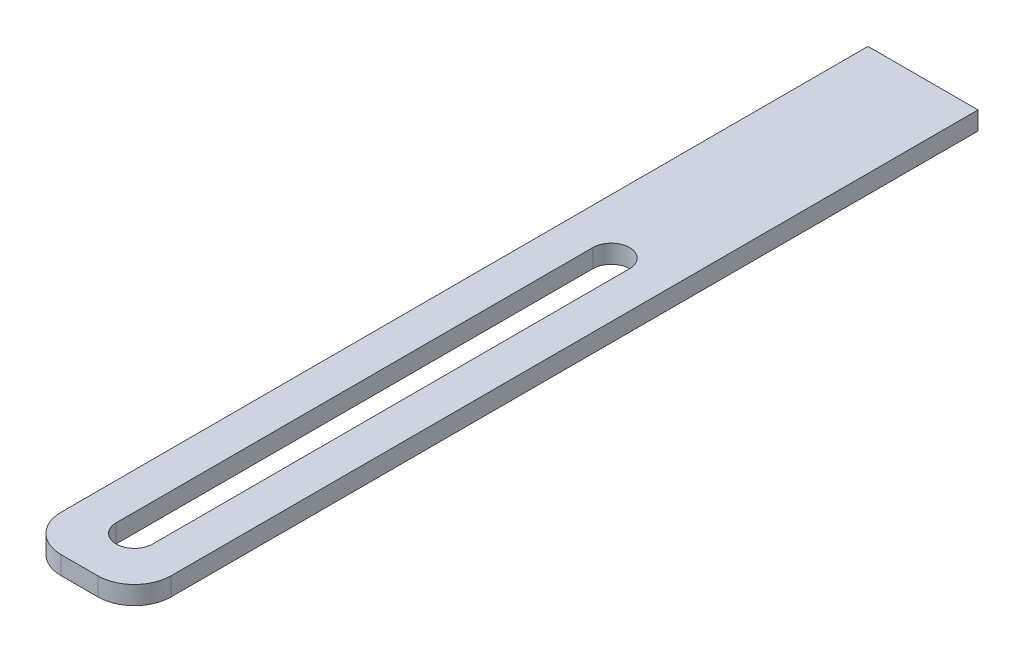
ISO-10303-21;
HEADER;
FILE_DESCRIPTION(('STEP AP214'),'2;1');
FILE_NAME('part.step','',(''),(''),'','','');
FILE_SCHEMA(('AUTOMOTIVE_DESIGN { 1 0 10303 214 1 1 1 1 }'));
ENDSEC;
DATA;
#1=APPLICATION_CONTEXT('core data for automotive mechanical design processes');
#2=APPLICATION_PROTOCOL_DEFINITION('international standard','automotive_design',2000,#1);
#3=PRODUCT_CONTEXT('',#1,'mechanical');
#4=PRODUCT('Part','Part','',(#3));
#5=PRODUCT_RELATED_PRODUCT_CATEGORY('part','',(#4));
#6=PRODUCT_DEFINITION_FORMATION('','',#4);
#7=PRODUCT_DEFINITION_CONTEXT('part definition',#1,'design');
#8=PRODUCT_DEFINITION('design','',#6,#7);
#9=PRODUCT_DEFINITION_SHAPE('','',#8);
#10=(LENGTH_UNIT() NAMED_UNIT(*) SI_UNIT(.MILLI.,.METRE.));
#11=(NAMED_UNIT(*) PLANE_ANGLE_UNIT() SI_UNIT($,.RADIAN.));
#12=(NAMED_UNIT(*) SI_UNIT($,.STERADIAN.) SOLID_ANGLE_UNIT());
#13=UNCERTAINTY_MEASURE_WITH_UNIT(LENGTH_MEASURE(1.E-05),#10,'distance_accuracy_value','');
#14=(GEOMETRIC_REPRESENTATION_CONTEXT(3) GLOBAL_UNCERTAINTY_ASSIGNED_CONTEXT((#13)) GLOBAL_UNIT_ASSIGNED_CONTEXT((#10,
#11,#12)) REPRESENTATION_CONTEXT('',''));
#15=CARTESIAN_POINT('',(0.,0.,0.));
#16=DIRECTION('',(0.,0.,1.));
#17=DIRECTION('',(1.,0.,0.));
#18=AXIS2_PLACEMENT_3D('',#15,#16,#17);
#19=CARTESIAN_POINT('',(305.,20.,205.));
#20=DIRECTION('',(0.,1.,0.));
#21=DIRECTION('',(0.,0.,1.));
#22=AXIS2_PLACEMENT_3D('',#19,#20,#21);
#23=PLANE('',#22);
#24=DIRECTION('',(0.,0.,1.));
#25=VECTOR('',#24,1.);
#26=CARTESIAN_POINT('',(285.,20.,205.));
#27=LINE('',#26,#25);
#28=CARTESIAN_POINT('',(285.,20.,-15.));
#29=VERTEX_POINT('',#28);
#30=CARTESIAN_POINT('',(285.,20.,205.));
#31=VERTEX_POINT('',#30);
#32=EDGE_CURVE('E169',#29,#31,#27,.T.);
#33=ORIENTED_EDGE('',*,*,#32,.T.);
#34=CARTESIAN_POINT('',(295.,20.,205.));
#35=DIRECTION('',(0.,1.,0.));
#36=DIRECTION('',(0.,0.,-1.));
#37=AXIS2_PLACEMENT_3D('',#34,#35,#36);
#38=CIRCLE('',#37,10.);
#39=CARTESIAN_POINT('',(295.,20.,215.));
#40=VERTEX_POINT('',#39);
#41=EDGE_CURVE('E173',#31,#40,#38,.T.);
#42=ORIENTED_EDGE('',*,*,#41,.T.);
#43=DIRECTION('',(1.,0.,0.));
#44=VECTOR('',#43,1.);
#45=CARTESIAN_POINT('',(305.,20.,215.));
#46=LINE('',#45,#44);
#47=CARTESIAN_POINT('',(305.,20.,215.));
#48=VERTEX_POINT('',#47);
#49=EDGE_CURVE('E177',#40,#48,#46,.T.);
#50=ORIENTED_EDGE('',*,*,#49,.T.);
#51=CARTESIAN_POINT('',(305.,20.,205.));
#52=DIRECTION('',(0.,1.,0.));
#53=DIRECTION('',(0.,0.,1.));
#54=AXIS2_PLACEMENT_3D('',#51,#52,#53);
#55=CIRCLE('',#54,10.);
#56=CARTESIAN_POINT('',(315.,20.,205.));
#57=VERTEX_POINT('',#56);
#58=EDGE_CURVE('E180',#48,#57,#55,.T.);
#59=ORIENTED_EDGE('',*,*,#58,.T.);
#60=DIRECTION('',(0.,0.,-1.));
#61=VECTOR('',#60,1.);
#62=CARTESIAN_POINT('',(315.,20.,205.));
#63=LINE('',#62,#61);
#64=CARTESIAN_POINT('',(315.,20.,-15.));
#65=VERTEX_POINT('',#64);
#66=EDGE_CURVE('E183',#57,#65,#63,.T.);
#67=ORIENTED_EDGE('',*,*,#66,.T.);
#68=DIRECTION('',(-1.,0.,0.));
#69=VECTOR('',#68,1.);
#70=CARTESIAN_POINT('',(315.,20.,-15.));
#71=LINE('',#70,#69);
#72=EDGE_CURVE('E186',#65,#29,#71,.T.);
#73=ORIENTED_EDGE('',*,*,#72,.T.);
#74=EDGE_LOOP('',(#33,#42,#50,#59,#67,#73));
#75=FACE_BOUND('',#74,.T.);
#76=DIRECTION('',(0.,0.,-1.));
#77=VECTOR('',#76,1.);
#78=CARTESIAN_POINT('',(305.,20.,200.));
#79=LINE('',#78,#77);
#80=CARTESIAN_POINT('',(305.,20.,200.));
#81=VERTEX_POINT('',#80);
#82=CARTESIAN_POINT('',(305.,20.,70.));
#83=VERTEX_POINT('',#82);
#84=EDGE_CURVE('E129',#81,#83,#79,.T.);
#85=ORIENTED_EDGE('',*,*,#84,.F.);
#86=CARTESIAN_POINT('',(300.,20.,200.));
#87=DIRECTION('',(0.,1.,0.));
#88=DIRECTION('',(0.,0.,1.));
#89=AXIS2_PLACEMENT_3D('',#86,#87,#88);
#90=CIRCLE('',#89,5.);
#91=CARTESIAN_POINT('',(295.,20.,200.));
#92=VERTEX_POINT('',#91);
#93=EDGE_CURVE('E120',#92,#81,#90,.T.);
#94=ORIENTED_EDGE('',*,*,#93,.F.);
#95=DIRECTION('',(0.,0.,1.));
#96=VECTOR('',#95,1.);
#97=CARTESIAN_POINT('',(295.,20.,200.));
#98=LINE('',#97,#96);
#99=CARTESIAN_POINT('',(295.,20.,70.));
#100=VERTEX_POINT('',#99);
#101=EDGE_CURVE('E147',#100,#92,#98,.T.);
#102=ORIENTED_EDGE('',*,*,#101,.F.);
#103=CARTESIAN_POINT('',(300.,20.,70.));
#104=DIRECTION('',(0.,1.,0.));
#105=DIRECTION('',(0.,0.,1.));
#106=AXIS2_PLACEMENT_3D('',#103,#104,#105);
#107=CIRCLE('',#106,5.00000000000012);
#108=EDGE_CURVE('E142',#83,#100,#107,.T.);
#109=ORIENTED_EDGE('',*,*,#108,.F.);
#110=EDGE_LOOP('',(#85,#94,#102,#109));
#111=FACE_BOUND('',#110,.T.);
#112=ADVANCED_FACE('F42',(#75,#111),#23,.T.);
#113=CARTESIAN_POINT('',(305.,15.,205.));
#114=DIRECTION('',(0.,1.,0.));
#115=DIRECTION('',(0.,0.,1.));
#116=AXIS2_PLACEMENT_3D('',#113,#114,#115);
#117=PLANE('',#116);
#118=DIRECTION('',(0.,0.,1.));
#119=VECTOR('',#118,1.);
#120=CARTESIAN_POINT('',(285.,15.,205.));
#121=LINE('',#120,#119);
#122=CARTESIAN_POINT('',(285.,15.,-15.));
#123=VERTEX_POINT('',#122);
#124=CARTESIAN_POINT('',(285.,15.,205.));
#125=VERTEX_POINT('',#124);
#126=EDGE_CURVE('E138',#123,#125,#121,.T.);
#127=ORIENTED_EDGE('',*,*,#126,.F.);
#128=DIRECTION('',(-1.,0.,0.));
#129=VECTOR('',#128,1.);
#130=CARTESIAN_POINT('',(315.,15.,-15.));
#131=LINE('',#130,#129);
#132=CARTESIAN_POINT('',(315.,15.,-15.));
#133=VERTEX_POINT('',#132);
#134=EDGE_CURVE('E174',#133,#123,#131,.T.);
#135=ORIENTED_EDGE('',*,*,#134,.F.);
#136=DIRECTION('',(0.,0.,-1.));
#137=VECTOR('',#136,1.);
#138=CARTESIAN_POINT('',(315.,15.,205.));
#139=LINE('',#138,#137);
#140=CARTESIAN_POINT('',(315.,15.,205.));
#141=VERTEX_POINT('',#140);
#142=EDGE_CURVE('E202',#141,#133,#139,.T.);
#143=ORIENTED_EDGE('',*,*,#142,.F.);
#144=CARTESIAN_POINT('',(305.,15.,205.));
#145=DIRECTION('',(0.,1.,0.));
#146=DIRECTION('',(0.,0.,1.));
#147=AXIS2_PLACEMENT_3D('',#144,#145,#146);
#148=CIRCLE('',#147,10.);
#149=CARTESIAN_POINT('',(305.,15.,215.));
#150=VERTEX_POINT('',#149);
#151=EDGE_CURVE('E199',#150,#141,#148,.T.);
#152=ORIENTED_EDGE('',*,*,#151,.F.);
#153=DIRECTION('',(1.,0.,0.));
#154=VECTOR('',#153,1.);
#155=CARTESIAN_POINT('',(305.,15.,215.));
#156=LINE('',#155,#154);
#157=CARTESIAN_POINT('',(295.,15.,215.));
#158=VERTEX_POINT('',#157);
#159=EDGE_CURVE('E196',#158,#150,#156,.T.);
#160=ORIENTED_EDGE('',*,*,#159,.F.);
#161=CARTESIAN_POINT('',(295.,15.,205.));
#162=DIRECTION('',(0.,1.,0.));
#163=DIRECTION('',(0.,0.,-1.));
#164=AXIS2_PLACEMENT_3D('',#161,#162,#163);
#165=CIRCLE('',#164,10.);
#166=EDGE_CURVE('E193',#125,#158,#165,.T.);
#167=ORIENTED_EDGE('',*,*,#166,.F.);
#168=EDGE_LOOP('',(#127,#135,#143,#152,#160,#167));
#169=FACE_BOUND('',#168,.T.);
#170=CARTESIAN_POINT('',(300.,15.,200.));
#171=DIRECTION('',(0.,1.,0.));
#172=DIRECTION('',(0.,0.,1.));
#173=AXIS2_PLACEMENT_3D('',#170,#171,#172);
#174=CIRCLE('',#173,5.);
#175=CARTESIAN_POINT('',(295.,15.,200.));
#176=VERTEX_POINT('',#175);
#177=CARTESIAN_POINT('',(305.,15.,200.));
#178=VERTEX_POINT('',#177);
#179=EDGE_CURVE('E66',#176,#178,#174,.T.);
#180=ORIENTED_EDGE('',*,*,#179,.T.);
#181=DIRECTION('',(0.,0.,-1.));
#182=VECTOR('',#181,1.);
#183=CARTESIAN_POINT('',(305.,15.,200.));
#184=LINE('',#183,#182);
#185=CARTESIAN_POINT('',(305.,15.,70.));
#186=VERTEX_POINT('',#185);
#187=EDGE_CURVE('E136',#178,#186,#184,.T.);
#188=ORIENTED_EDGE('',*,*,#187,.T.);
#189=CARTESIAN_POINT('',(300.,15.,70.));
#190=DIRECTION('',(0.,1.,0.));
#191=DIRECTION('',(0.,0.,1.));
#192=AXIS2_PLACEMENT_3D('',#189,#190,#191);
#193=CIRCLE('',#192,5.00000000000012);
#194=CARTESIAN_POINT('',(295.,15.,70.));
#195=VERTEX_POINT('',#194);
#196=EDGE_CURVE('E156',#186,#195,#193,.T.);
#197=ORIENTED_EDGE('',*,*,#196,.T.);
#198=DIRECTION('',(0.,0.,1.));
#199=VECTOR('',#198,1.);
#200=CARTESIAN_POINT('',(295.,15.,200.));
#201=LINE('',#200,#199);
#202=EDGE_CURVE('E130',#195,#176,#201,.T.);
#203=ORIENTED_EDGE('',*,*,#202,.T.);
#204=EDGE_LOOP('',(#180,#188,#197,#203));
#205=FACE_BOUND('',#204,.T.);
#206=ADVANCED_FACE('F234',(#169,#205),#117,.F.);
#207=CARTESIAN_POINT('',(285.,20.,205.));
#208=DIRECTION('',(1.,0.,0.));
#209=DIRECTION('',(0.,0.,-1.));
#210=AXIS2_PLACEMENT_3D('',#207,#208,#209);
#211=PLANE('',#210);
#212=ORIENTED_EDGE('',*,*,#126,.T.);
#213=DIRECTION('',(0.,-1.,0.));
#214=VECTOR('',#213,1.);
#215=CARTESIAN_POINT('',(285.,20.,205.));
#216=LINE('',#215,#214);
#217=EDGE_CURVE('E11',#31,#125,#216,.T.);
#218=ORIENTED_EDGE('',*,*,#217,.F.);
#219=ORIENTED_EDGE('',*,*,#32,.F.);
#220=DIRECTION('',(0.,-1.,0.));
#221=VECTOR('',#220,1.);
#222=CARTESIAN_POINT('',(285.,20.,-15.));
#223=LINE('',#222,#221);
#224=EDGE_CURVE('E189',#29,#123,#223,.T.);
#225=ORIENTED_EDGE('',*,*,#224,.T.);
#226=EDGE_LOOP('',(#212,#218,#219,#225));
#227=FACE_BOUND('',#226,.T.);
#228=ADVANCED_FACE('F44',(#227),#211,.F.);
#229=CARTESIAN_POINT('',(295.,20.,205.));
#230=DIRECTION('',(0.,-1.,0.));
#231=DIRECTION('',(0.,0.,-1.));
#232=AXIS2_PLACEMENT_3D('',#229,#230,#231);
#233=CYLINDRICAL_SURFACE('',#232,10.);
#234=ORIENTED_EDGE('',*,*,#166,.T.);
#235=DIRECTION('',(0.,-1.,0.));
#236=VECTOR('',#235,1.);
#237=CARTESIAN_POINT('',(295.,20.,215.));
#238=LINE('',#237,#236);
#239=EDGE_CURVE('E51',#40,#158,#238,.T.);
#240=ORIENTED_EDGE('',*,*,#239,.F.);
#241=ORIENTED_EDGE('',*,*,#41,.F.);
#242=ORIENTED_EDGE('',*,*,#217,.T.);
#243=EDGE_LOOP('',(#234,#240,#241,#242));
#244=FACE_BOUND('',#243,.T.);
#245=ADVANCED_FACE('F251',(#244),#233,.T.);
#246=CARTESIAN_POINT('',(305.,20.,215.));
#247=DIRECTION('',(0.,0.,-1.));
#248=DIRECTION('',(-1.,0.,0.));
#249=AXIS2_PLACEMENT_3D('',#246,#247,#248);
#250=PLANE('',#249);
#251=ORIENTED_EDGE('',*,*,#159,.T.);
#252=DIRECTION('',(0.,-1.,0.));
#253=VECTOR('',#252,1.);
#254=CARTESIAN_POINT('',(305.,20.,215.));
#255=LINE('',#254,#253);
#256=EDGE_CURVE('E218',#48,#150,#255,.T.);
#257=ORIENTED_EDGE('',*,*,#256,.F.);
#258=ORIENTED_EDGE('',*,*,#49,.F.);
#259=ORIENTED_EDGE('',*,*,#239,.T.);
#260=EDGE_LOOP('',(#251,#257,#258,#259));
#261=FACE_BOUND('',#260,.T.);
#262=ADVANCED_FACE('F228',(#261),#250,.F.);
#263=CARTESIAN_POINT('',(305.,20.,205.));
#264=DIRECTION('',(0.,-1.,0.));
#265=DIRECTION('',(0.,0.,-1.));
#266=AXIS2_PLACEMENT_3D('',#263,#264,#265);
#267=CYLINDRICAL_SURFACE('',#266,10.);
#268=ORIENTED_EDGE('',*,*,#151,.T.);
#269=DIRECTION('',(0.,-1.,0.));
#270=VECTOR('',#269,1.);
#271=CARTESIAN_POINT('',(315.,20.,205.));
#272=LINE('',#271,#270);
#273=EDGE_CURVE('E214',#57,#141,#272,.T.);
#274=ORIENTED_EDGE('',*,*,#273,.F.);
#275=ORIENTED_EDGE('',*,*,#58,.F.);
#276=ORIENTED_EDGE('',*,*,#256,.T.);
#277=EDGE_LOOP('',(#268,#274,#275,#276));
#278=FACE_BOUND('',#277,.T.);
#279=ADVANCED_FACE('F240',(#278),#267,.T.);
#280=CARTESIAN_POINT('',(315.,20.,205.));
#281=DIRECTION('',(-1.,0.,0.));
#282=DIRECTION('',(0.,0.,1.));
#283=AXIS2_PLACEMENT_3D('',#280,#281,#282);
#284=PLANE('',#283);
#285=ORIENTED_EDGE('',*,*,#142,.T.);
#286=DIRECTION('',(0.,-1.,0.));
#287=VECTOR('',#286,1.);
#288=CARTESIAN_POINT('',(315.,20.,-15.));
#289=LINE('',#288,#287);
#290=EDGE_CURVE('E210',#65,#133,#289,.T.);
#291=ORIENTED_EDGE('',*,*,#290,.F.);
#292=ORIENTED_EDGE('',*,*,#66,.F.);
#293=ORIENTED_EDGE('',*,*,#273,.T.);
#294=EDGE_LOOP('',(#285,#291,#292,#293));
#295=FACE_BOUND('',#294,.T.);
#296=ADVANCED_FACE('F244',(#295),#284,.F.);
#297=CARTESIAN_POINT('',(315.,20.,-15.));
#298=DIRECTION('',(0.,0.,1.));
#299=DIRECTION('',(1.,0.,0.));
#300=AXIS2_PLACEMENT_3D('',#297,#298,#299);
#301=PLANE('',#300);
#302=ORIENTED_EDGE('',*,*,#134,.T.);
#303=ORIENTED_EDGE('',*,*,#224,.F.);
#304=ORIENTED_EDGE('',*,*,#72,.F.);
#305=ORIENTED_EDGE('',*,*,#290,.T.);
#306=EDGE_LOOP('',(#302,#303,#304,#305));
#307=FACE_BOUND('',#306,.T.);
#308=ADVANCED_FACE('F254',(#307),#301,.F.);
#309=CARTESIAN_POINT('',(300.,20.,200.));
#310=DIRECTION('',(0.,-1.,0.));
#311=DIRECTION('',(0.,0.,-1.));
#312=AXIS2_PLACEMENT_3D('',#309,#310,#311);
#313=CYLINDRICAL_SURFACE('',#312,5.);
#314=ORIENTED_EDGE('',*,*,#179,.F.);
#315=DIRECTION('',(0.,-1.,0.));
#316=VECTOR('',#315,1.);
#317=CARTESIAN_POINT('',(295.,20.,200.));
#318=LINE('',#317,#316);
#319=EDGE_CURVE('E124',#92,#176,#318,.T.);
#320=ORIENTED_EDGE('',*,*,#319,.F.);
#321=ORIENTED_EDGE('',*,*,#93,.T.);
#322=DIRECTION('',(0.,-1.,0.));
#323=VECTOR('',#322,1.);
#324=CARTESIAN_POINT('',(305.,20.,200.));
#325=LINE('',#324,#323);
#326=EDGE_CURVE('E123',#81,#178,#325,.T.);
#327=ORIENTED_EDGE('',*,*,#326,.T.);
#328=EDGE_LOOP('',(#314,#320,#321,#327));
#329=FACE_BOUND('',#328,.T.);
#330=ADVANCED_FACE('F122',(#329),#313,.F.);
#331=CARTESIAN_POINT('',(305.,20.,200.));
#332=DIRECTION('',(-1.,0.,0.));
#333=DIRECTION('',(0.,0.,1.));
#334=AXIS2_PLACEMENT_3D('',#331,#332,#333);
#335=PLANE('',#334);
#336=ORIENTED_EDGE('',*,*,#187,.F.);
#337=ORIENTED_EDGE('',*,*,#326,.F.);
#338=ORIENTED_EDGE('',*,*,#84,.T.);
#339=DIRECTION('',(0.,-1.,0.));
#340=VECTOR('',#339,1.);
#341=CARTESIAN_POINT('',(305.,20.,70.));
#342=LINE('',#341,#340);
#343=EDGE_CURVE('E139',#83,#186,#342,.T.);
#344=ORIENTED_EDGE('',*,*,#343,.T.);
#345=EDGE_LOOP('',(#336,#337,#338,#344));
#346=FACE_BOUND('',#345,.T.);
#347=ADVANCED_FACE('F133',(#346),#335,.T.);
#348=CARTESIAN_POINT('',(300.,20.,70.));
#349=DIRECTION('',(0.,-1.,0.));
#350=DIRECTION('',(0.,0.,-1.));
#351=AXIS2_PLACEMENT_3D('',#348,#349,#350);
#352=CYLINDRICAL_SURFACE('',#351,5.00000000000012);
#353=ORIENTED_EDGE('',*,*,#196,.F.);
#354=ORIENTED_EDGE('',*,*,#343,.F.);
#355=ORIENTED_EDGE('',*,*,#108,.T.);
#356=DIRECTION('',(0.,-1.,0.));
#357=VECTOR('',#356,1.);
#358=CARTESIAN_POINT('',(295.,20.,70.));
#359=LINE('',#358,#357);
#360=EDGE_CURVE('E58',#100,#195,#359,.T.);
#361=ORIENTED_EDGE('',*,*,#360,.T.);
#362=EDGE_LOOP('',(#353,#354,#355,#361));
#363=FACE_BOUND('',#362,.T.);
#364=ADVANCED_FACE('F272',(#363),#352,.F.);
#365=CARTESIAN_POINT('',(295.,20.,200.));
#366=DIRECTION('',(1.,0.,0.));
#367=DIRECTION('',(0.,0.,-1.));
#368=AXIS2_PLACEMENT_3D('',#365,#366,#367);
#369=PLANE('',#368);
#370=ORIENTED_EDGE('',*,*,#202,.F.);
#371=ORIENTED_EDGE('',*,*,#360,.F.);
#372=ORIENTED_EDGE('',*,*,#101,.T.);
#373=ORIENTED_EDGE('',*,*,#319,.T.);
#374=EDGE_LOOP('',(#370,#371,#372,#373));
#375=FACE_BOUND('',#374,.T.);
#376=ADVANCED_FACE('F275',(#375),#369,.T.);
#377=CLOSED_SHELL('',(#112,#206,#228,#245,#262,#279,#296,#308,#330,#347,#364,#376));
#378=MANIFOLD_SOLID_BREP('B2',#377);
#379=ADVANCED_BREP_SHAPE_REPRESENTATION('',(#18,#378),#14);
#380=SHAPE_DEFINITION_REPRESENTATION(#9,#379);
ENDSEC;
END-ISO-10303-21;
